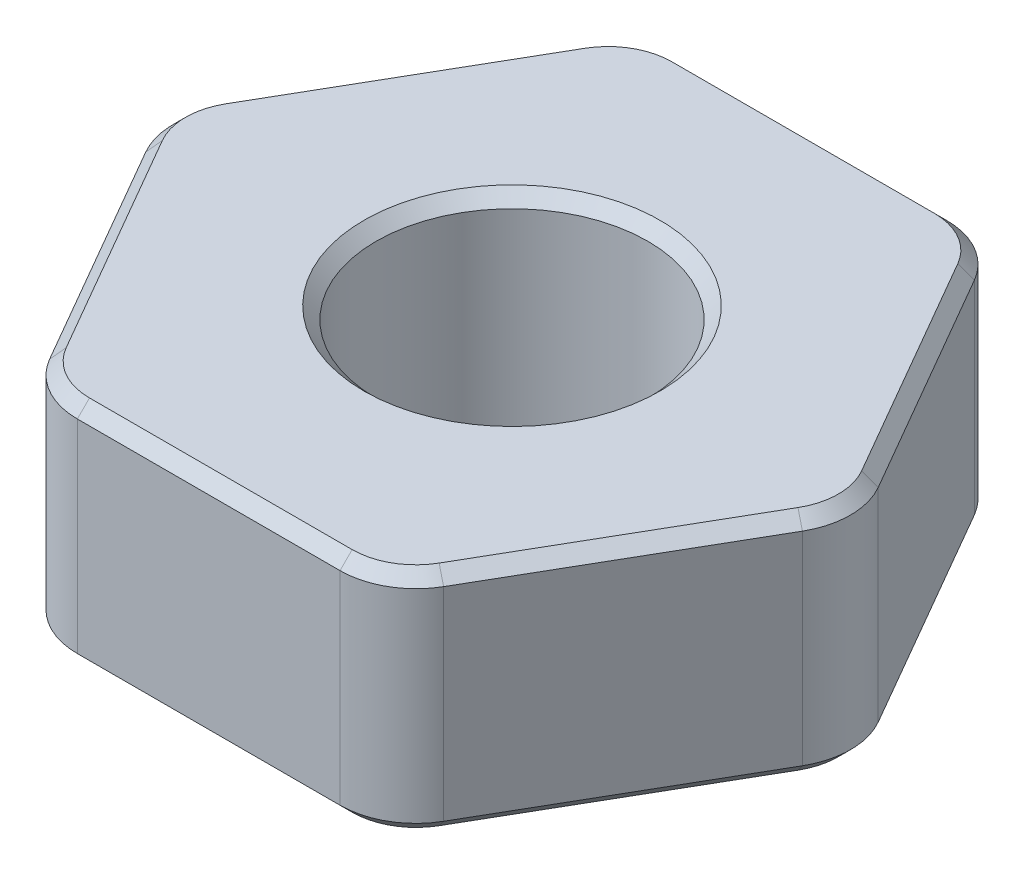
ISO-10303-21;
HEADER;
FILE_DESCRIPTION(('STEP AP214'),'2;1');
FILE_NAME('part.step','',(''),(''),'','','');
FILE_SCHEMA(('AUTOMOTIVE_DESIGN { 1 0 10303 214 1 1 1 1 }'));
ENDSEC;
DATA;
#1=APPLICATION_CONTEXT('core data for automotive mechanical design processes');
#2=APPLICATION_PROTOCOL_DEFINITION('international standard','automotive_design',2000,#1);
#3=PRODUCT_CONTEXT('',#1,'mechanical');
#4=PRODUCT('Part','Part','',(#3));
#5=PRODUCT_RELATED_PRODUCT_CATEGORY('part','',(#4));
#6=PRODUCT_DEFINITION_FORMATION('','',#4);
#7=PRODUCT_DEFINITION_CONTEXT('part definition',#1,'design');
#8=PRODUCT_DEFINITION('design','',#6,#7);
#9=PRODUCT_DEFINITION_SHAPE('','',#8);
#10=(LENGTH_UNIT() NAMED_UNIT(*) SI_UNIT(.MILLI.,.METRE.));
#11=(NAMED_UNIT(*) PLANE_ANGLE_UNIT() SI_UNIT($,.RADIAN.));
#12=(NAMED_UNIT(*) SI_UNIT($,.STERADIAN.) SOLID_ANGLE_UNIT());
#13=UNCERTAINTY_MEASURE_WITH_UNIT(LENGTH_MEASURE(1.E-05),#10,'distance_accuracy_value','');
#14=(GEOMETRIC_REPRESENTATION_CONTEXT(3) GLOBAL_UNCERTAINTY_ASSIGNED_CONTEXT((#13)) GLOBAL_UNIT_ASSIGNED_CONTEXT((#10,
#11,#12)) REPRESENTATION_CONTEXT('',''));
#15=CARTESIAN_POINT('',(0.,0.,0.));
#16=DIRECTION('',(0.,0.,1.));
#17=DIRECTION('',(1.,0.,0.));
#18=AXIS2_PLACEMENT_3D('',#15,#16,#17);
#19=CARTESIAN_POINT('',(0.,1.190625,0.));
#20=DIRECTION('',(0.,1.,0.));
#21=DIRECTION('',(0.,0.,1.));
#22=AXIS2_PLACEMENT_3D('',#19,#20,#21);
#23=PLANE('',#22);
#24=CARTESIAN_POINT('',(0.,1.190625,0.));
#25=DIRECTION('',(0.,1.,0.));
#26=DIRECTION('',(0.,0.,1.));
#27=AXIS2_PLACEMENT_3D('',#24,#25,#26);
#28=CIRCLE('',#27,1.5494);
#29=CARTESIAN_POINT('',(0.,1.190625,1.5494));
#30=VERTEX_POINT('',#29);
#31=EDGE_CURVE('E327',#30,#30,#28,.F.);
#32=ORIENTED_EDGE('',*,*,#31,.T.);
#33=EDGE_LOOP('',(#32));
#34=FACE_BOUND('',#33,.T.);
#35=CARTESIAN_POINT('',(1.3748153285078,1.190625,-2.38125));
#36=DIRECTION('',(0.,1.,0.));
#37=DIRECTION('',(0.,0.,1.));
#38=AXIS2_PLACEMENT_3D('',#35,#36,#37);
#39=CIRCLE('',#38,0.666750000000001);
#40=CARTESIAN_POINT('',(1.95223776648107,1.190625,-2.714625));
#41=VERTEX_POINT('',#40);
#42=CARTESIAN_POINT('',(1.3748153285078,1.190625,-3.048));
#43=VERTEX_POINT('',#42);
#44=EDGE_CURVE('E335',#41,#43,#39,.T.);
#45=ORIENTED_EDGE('',*,*,#44,.T.);
#46=DIRECTION('',(-1.,0.,0.));
#47=VECTOR('',#46,1.);
#48=CARTESIAN_POINT('',(-1.3748153285078,1.190625,-3.048));
#49=LINE('',#48,#47);
#50=CARTESIAN_POINT('',(-1.3748153285078,1.190625,-3.048));
#51=VERTEX_POINT('',#50);
#52=EDGE_CURVE('E330',#43,#51,#49,.T.);
#53=ORIENTED_EDGE('',*,*,#52,.T.);
#54=CARTESIAN_POINT('',(-1.3748153285078,1.190625,-2.38125));
#55=DIRECTION('',(0.,1.,0.));
#56=DIRECTION('',(0.,0.,1.));
#57=AXIS2_PLACEMENT_3D('',#54,#55,#56);
#58=CIRCLE('',#57,0.66675);
#59=CARTESIAN_POINT('',(-1.95223776648107,1.190625,-2.714625));
#60=VERTEX_POINT('',#59);
#61=EDGE_CURVE('E333',#51,#60,#58,.T.);
#62=ORIENTED_EDGE('',*,*,#61,.T.);
#63=DIRECTION('',(-0.5,0.,0.866025403784439));
#64=VECTOR('',#63,1.);
#65=CARTESIAN_POINT('',(-3.32705309498887,1.190625,-0.333375));
#66=LINE('',#65,#64);
#67=CARTESIAN_POINT('',(-3.32705309498887,1.190625,-0.333375));
#68=VERTEX_POINT('',#67);
#69=EDGE_CURVE('E337',#60,#68,#66,.T.);
#70=ORIENTED_EDGE('',*,*,#69,.T.);
#71=CARTESIAN_POINT('',(-2.74963065701559,1.190625,0.));
#72=DIRECTION('',(0.,1.,0.));
#73=DIRECTION('',(0.,0.,1.));
#74=AXIS2_PLACEMENT_3D('',#71,#72,#73);
#75=CIRCLE('',#74,0.666750000000001);
#76=CARTESIAN_POINT('',(-3.32705309498887,1.190625,0.333375000000001));
#77=VERTEX_POINT('',#76);
#78=EDGE_CURVE('E341',#68,#77,#75,.T.);
#79=ORIENTED_EDGE('',*,*,#78,.T.);
#80=DIRECTION('',(0.5,0.,0.866025403784439));
#81=VECTOR('',#80,1.);
#82=CARTESIAN_POINT('',(-1.95223776648107,1.190625,2.714625));
#83=LINE('',#82,#81);
#84=CARTESIAN_POINT('',(-1.95223776648107,1.190625,2.714625));
#85=VERTEX_POINT('',#84);
#86=EDGE_CURVE('E345',#77,#85,#83,.T.);
#87=ORIENTED_EDGE('',*,*,#86,.T.);
#88=CARTESIAN_POINT('',(-1.37481532850779,1.190625,2.38125));
#89=DIRECTION('',(0.,1.,0.));
#90=DIRECTION('',(0.,0.,1.));
#91=AXIS2_PLACEMENT_3D('',#88,#89,#90);
#92=CIRCLE('',#91,0.666750000000001);
#93=CARTESIAN_POINT('',(-1.37481532850779,1.190625,3.048));
#94=VERTEX_POINT('',#93);
#95=EDGE_CURVE('E349',#85,#94,#92,.T.);
#96=ORIENTED_EDGE('',*,*,#95,.T.);
#97=DIRECTION('',(1.,0.,0.));
#98=VECTOR('',#97,1.);
#99=CARTESIAN_POINT('',(1.3748153285078,1.190625,3.048));
#100=LINE('',#99,#98);
#101=CARTESIAN_POINT('',(1.3748153285078,1.190625,3.048));
#102=VERTEX_POINT('',#101);
#103=EDGE_CURVE('E353',#94,#102,#100,.T.);
#104=ORIENTED_EDGE('',*,*,#103,.T.);
#105=CARTESIAN_POINT('',(1.3748153285078,1.190625,2.38125));
#106=DIRECTION('',(0.,1.,0.));
#107=DIRECTION('',(0.,0.,1.));
#108=AXIS2_PLACEMENT_3D('',#105,#106,#107);
#109=CIRCLE('',#108,0.66675);
#110=CARTESIAN_POINT('',(1.95223776648107,1.190625,2.714625));
#111=VERTEX_POINT('',#110);
#112=EDGE_CURVE('E351',#102,#111,#109,.T.);
#113=ORIENTED_EDGE('',*,*,#112,.T.);
#114=DIRECTION('',(0.5,0.,-0.866025403784439));
#115=VECTOR('',#114,1.);
#116=CARTESIAN_POINT('',(3.32705309498887,1.190625,0.333375000000002));
#117=LINE('',#116,#115);
#118=CARTESIAN_POINT('',(3.32705309498887,1.190625,0.333375000000001));
#119=VERTEX_POINT('',#118);
#120=EDGE_CURVE('E347',#111,#119,#117,.T.);
#121=ORIENTED_EDGE('',*,*,#120,.T.);
#122=CARTESIAN_POINT('',(2.74963065701559,1.190625,0.));
#123=DIRECTION('',(0.,1.,0.));
#124=DIRECTION('',(0.,0.,1.));
#125=AXIS2_PLACEMENT_3D('',#122,#123,#124);
#126=CIRCLE('',#125,0.666750000000001);
#127=CARTESIAN_POINT('',(3.32705309498887,1.190625,-0.333375));
#128=VERTEX_POINT('',#127);
#129=EDGE_CURVE('E343',#119,#128,#126,.T.);
#130=ORIENTED_EDGE('',*,*,#129,.T.);
#131=DIRECTION('',(-0.5,0.,-0.866025403784439));
#132=VECTOR('',#131,1.);
#133=CARTESIAN_POINT('',(1.95223776648107,1.190625,-2.714625));
#134=LINE('',#133,#132);
#135=EDGE_CURVE('E339',#128,#41,#134,.T.);
#136=ORIENTED_EDGE('',*,*,#135,.T.);
#137=EDGE_LOOP('',(#45,#53,#62,#70,#79,#87,#96,#104,#113,#121,#130,#136));
#138=FACE_BOUND('',#137,.T.);
#139=ADVANCED_FACE('F32',(#34,#138),#23,.T.);
#140=CARTESIAN_POINT('',(0.,-1.190625,0.));
#141=DIRECTION('',(0.,1.,0.));
#142=DIRECTION('',(0.,0.,1.));
#143=AXIS2_PLACEMENT_3D('',#140,#141,#142);
#144=PLANE('',#143);
#145=CARTESIAN_POINT('',(0.,-1.190625,0.));
#146=DIRECTION('',(0.,1.,0.));
#147=DIRECTION('',(0.,0.,1.));
#148=AXIS2_PLACEMENT_3D('',#145,#146,#147);
#149=CIRCLE('',#148,1.5494);
#150=CARTESIAN_POINT('',(0.,-1.190625,1.5494));
#151=VERTEX_POINT('',#150);
#152=EDGE_CURVE('E361',#151,#151,#149,.T.);
#153=ORIENTED_EDGE('',*,*,#152,.T.);
#154=EDGE_LOOP('',(#153));
#155=FACE_BOUND('',#154,.T.);
#156=CARTESIAN_POINT('',(-1.3748153285078,-1.190625,-2.38125));
#157=DIRECTION('',(0.,1.,0.));
#158=DIRECTION('',(0.,0.,1.));
#159=AXIS2_PLACEMENT_3D('',#156,#157,#158);
#160=CIRCLE('',#159,0.666749999999999);
#161=CARTESIAN_POINT('',(-1.95223776648107,-1.190625,-2.714625));
#162=VERTEX_POINT('',#161);
#163=CARTESIAN_POINT('',(-1.3748153285078,-1.190625,-3.048));
#164=VERTEX_POINT('',#163);
#165=EDGE_CURVE('E367',#162,#164,#160,.F.);
#166=ORIENTED_EDGE('',*,*,#165,.T.);
#167=DIRECTION('',(1.,0.,0.));
#168=VECTOR('',#167,1.);
#169=CARTESIAN_POINT('',(0.,-1.190625,-3.048));
#170=LINE('',#169,#168);
#171=CARTESIAN_POINT('',(1.3748153285078,-1.190625,-3.048));
#172=VERTEX_POINT('',#171);
#173=EDGE_CURVE('E364',#164,#172,#170,.T.);
#174=ORIENTED_EDGE('',*,*,#173,.T.);
#175=CARTESIAN_POINT('',(1.3748153285078,-1.190625,-2.38125));
#176=DIRECTION('',(0.,1.,0.));
#177=DIRECTION('',(0.,0.,1.));
#178=AXIS2_PLACEMENT_3D('',#175,#176,#177);
#179=CIRCLE('',#178,0.666749999999999);
#180=CARTESIAN_POINT('',(1.95223776648107,-1.190625,-2.714625));
#181=VERTEX_POINT('',#180);
#182=EDGE_CURVE('E369',#172,#181,#179,.F.);
#183=ORIENTED_EDGE('',*,*,#182,.T.);
#184=DIRECTION('',(0.5,0.,0.866025403784439));
#185=VECTOR('',#184,1.);
#186=CARTESIAN_POINT('',(2.63964543073497,-1.190625,-1.524));
#187=LINE('',#186,#185);
#188=CARTESIAN_POINT('',(3.32705309498887,-1.190625,-0.333375));
#189=VERTEX_POINT('',#188);
#190=EDGE_CURVE('E373',#181,#189,#187,.T.);
#191=ORIENTED_EDGE('',*,*,#190,.T.);
#192=CARTESIAN_POINT('',(2.74963065701559,-1.190625,0.));
#193=DIRECTION('',(0.,1.,0.));
#194=DIRECTION('',(0.,0.,1.));
#195=AXIS2_PLACEMENT_3D('',#192,#193,#194);
#196=CIRCLE('',#195,0.666749999999999);
#197=CARTESIAN_POINT('',(3.32705309498887,-1.190625,0.333375));
#198=VERTEX_POINT('',#197);
#199=EDGE_CURVE('E377',#189,#198,#196,.F.);
#200=ORIENTED_EDGE('',*,*,#199,.T.);
#201=DIRECTION('',(-0.5,0.,0.866025403784439));
#202=VECTOR('',#201,1.);
#203=CARTESIAN_POINT('',(2.63964543073497,-1.190625,1.524));
#204=LINE('',#203,#202);
#205=CARTESIAN_POINT('',(1.95223776648107,-1.190625,2.714625));
#206=VERTEX_POINT('',#205);
#207=EDGE_CURVE('E200',#198,#206,#204,.T.);
#208=ORIENTED_EDGE('',*,*,#207,.T.);
#209=CARTESIAN_POINT('',(1.3748153285078,-1.190625,2.38125));
#210=DIRECTION('',(0.,1.,0.));
#211=DIRECTION('',(0.,0.,1.));
#212=AXIS2_PLACEMENT_3D('',#209,#210,#211);
#213=CIRCLE('',#212,0.666749999999999);
#214=CARTESIAN_POINT('',(1.3748153285078,-1.190625,3.048));
#215=VERTEX_POINT('',#214);
#216=EDGE_CURVE('E194',#206,#215,#213,.F.);
#217=ORIENTED_EDGE('',*,*,#216,.T.);
#218=DIRECTION('',(-1.,0.,0.));
#219=VECTOR('',#218,1.);
#220=CARTESIAN_POINT('',(0.,-1.190625,3.048));
#221=LINE('',#220,#219);
#222=CARTESIAN_POINT('',(-1.37481532850779,-1.190625,3.048));
#223=VERTEX_POINT('',#222);
#224=EDGE_CURVE('E197',#215,#223,#221,.T.);
#225=ORIENTED_EDGE('',*,*,#224,.T.);
#226=CARTESIAN_POINT('',(-1.37481532850779,-1.190625,2.38125));
#227=DIRECTION('',(0.,1.,0.));
#228=DIRECTION('',(0.,0.,1.));
#229=AXIS2_PLACEMENT_3D('',#226,#227,#228);
#230=CIRCLE('',#229,0.666749999999999);
#231=CARTESIAN_POINT('',(-1.95223776648107,-1.190625,2.714625));
#232=VERTEX_POINT('',#231);
#233=EDGE_CURVE('E205',#223,#232,#230,.F.);
#234=ORIENTED_EDGE('',*,*,#233,.T.);
#235=DIRECTION('',(-0.5,0.,-0.866025403784439));
#236=VECTOR('',#235,1.);
#237=CARTESIAN_POINT('',(-2.63964543073497,-1.190625,1.524));
#238=LINE('',#237,#236);
#239=CARTESIAN_POINT('',(-3.32705309498886,-1.190625,0.333375));
#240=VERTEX_POINT('',#239);
#241=EDGE_CURVE('E379',#232,#240,#238,.T.);
#242=ORIENTED_EDGE('',*,*,#241,.T.);
#243=CARTESIAN_POINT('',(-2.74963065701559,-1.190625,0.));
#244=DIRECTION('',(0.,1.,0.));
#245=DIRECTION('',(0.,0.,1.));
#246=AXIS2_PLACEMENT_3D('',#243,#244,#245);
#247=CIRCLE('',#246,0.666749999999999);
#248=CARTESIAN_POINT('',(-3.32705309498886,-1.190625,-0.333374999999999));
#249=VERTEX_POINT('',#248);
#250=EDGE_CURVE('E375',#240,#249,#247,.F.);
#251=ORIENTED_EDGE('',*,*,#250,.T.);
#252=DIRECTION('',(0.5,0.,-0.866025403784439));
#253=VECTOR('',#252,1.);
#254=CARTESIAN_POINT('',(-2.63964543073497,-1.190625,-1.524));
#255=LINE('',#254,#253);
#256=EDGE_CURVE('E371',#249,#162,#255,.T.);
#257=ORIENTED_EDGE('',*,*,#256,.T.);
#258=EDGE_LOOP('',(#166,#174,#183,#191,#200,#208,#217,#225,#234,#242,#251,#257));
#259=FACE_BOUND('',#258,.T.);
#260=ADVANCED_FACE('F196',(#155,#259),#144,.F.);
#261=CARTESIAN_POINT('',(3.66617420935412,1.190625,0.));
#262=DIRECTION('',(-0.866025403784439,0.,0.5));
#263=DIRECTION('',(0.5,0.,0.866025403784438));
#264=AXIS2_PLACEMENT_3D('',#261,#262,#263);
#265=PLANE('',#264);
#266=DIRECTION('',(0.,-1.,0.));
#267=VECTOR('',#266,1.);
#268=CARTESIAN_POINT('',(2.06222299276169,1.190625,-2.778125));
#269=LINE('',#268,#267);
#270=CARTESIAN_POINT('',(2.06222299276169,-1.063625,-2.778125));
#271=VERTEX_POINT('',#270);
#272=CARTESIAN_POINT('',(2.06222299276169,1.063625,-2.778125));
#273=VERTEX_POINT('',#272);
#274=EDGE_CURVE('E253',#271,#273,#269,.F.);
#275=ORIENTED_EDGE('',*,*,#274,.T.);
#276=DIRECTION('',(0.5,0.,0.866025403784438));
#277=VECTOR('',#276,1.);
#278=CARTESIAN_POINT('',(3.43703832126949,1.063625,-0.396875000000001));
#279=LINE('',#278,#277);
#280=CARTESIAN_POINT('',(3.43703832126949,1.063625,-0.396875));
#281=VERTEX_POINT('',#280);
#282=EDGE_CURVE('E305',#273,#281,#279,.T.);
#283=ORIENTED_EDGE('',*,*,#282,.T.);
#284=DIRECTION('',(0.,-1.,0.));
#285=VECTOR('',#284,1.);
#286=CARTESIAN_POINT('',(3.43703832126949,1.190625,-0.396875));
#287=LINE('',#286,#285);
#288=CARTESIAN_POINT('',(3.43703832126949,-1.063625,-0.396875));
#289=VERTEX_POINT('',#288);
#290=EDGE_CURVE('E410',#281,#289,#287,.T.);
#291=ORIENTED_EDGE('',*,*,#290,.T.);
#292=DIRECTION('',(-0.5,0.,-0.866025403784438));
#293=VECTOR('',#292,1.);
#294=CARTESIAN_POINT('',(3.66617420935412,-1.063625,0.));
#295=LINE('',#294,#293);
#296=EDGE_CURVE('E307',#289,#271,#295,.T.);
#297=ORIENTED_EDGE('',*,*,#296,.T.);
#298=EDGE_LOOP('',(#275,#283,#291,#297));
#299=FACE_BOUND('',#298,.T.);
#300=ADVANCED_FACE('F417',(#299),#265,.F.);
#301=CARTESIAN_POINT('',(1.83308710467706,1.190625,-3.175));
#302=DIRECTION('',(0.,0.,1.));
#303=DIRECTION('',(1.,0.,0.));
#304=AXIS2_PLACEMENT_3D('',#301,#302,#303);
#305=PLANE('',#304);
#306=DIRECTION('',(0.,-1.,0.));
#307=VECTOR('',#306,1.);
#308=CARTESIAN_POINT('',(-1.3748153285078,1.190625,-3.175));
#309=LINE('',#308,#307);
#310=CARTESIAN_POINT('',(-1.3748153285078,-1.063625,-3.175));
#311=VERTEX_POINT('',#310);
#312=CARTESIAN_POINT('',(-1.3748153285078,1.063625,-3.175));
#313=VERTEX_POINT('',#312);
#314=EDGE_CURVE('E213',#311,#313,#309,.F.);
#315=ORIENTED_EDGE('',*,*,#314,.T.);
#316=DIRECTION('',(1.,0.,0.));
#317=VECTOR('',#316,1.);
#318=CARTESIAN_POINT('',(1.3748153285078,1.063625,-3.175));
#319=LINE('',#318,#317);
#320=CARTESIAN_POINT('',(1.3748153285078,1.063625,-3.175));
#321=VERTEX_POINT('',#320);
#322=EDGE_CURVE('E321',#313,#321,#319,.T.);
#323=ORIENTED_EDGE('',*,*,#322,.T.);
#324=DIRECTION('',(0.,-1.,0.));
#325=VECTOR('',#324,1.);
#326=CARTESIAN_POINT('',(1.3748153285078,1.190625,-3.175));
#327=LINE('',#326,#325);
#328=CARTESIAN_POINT('',(1.3748153285078,-1.063625,-3.175));
#329=VERTEX_POINT('',#328);
#330=EDGE_CURVE('E385',#321,#329,#327,.T.);
#331=ORIENTED_EDGE('',*,*,#330,.T.);
#332=DIRECTION('',(-1.,0.,0.));
#333=VECTOR('',#332,1.);
#334=CARTESIAN_POINT('',(1.83308710467706,-1.063625,-3.175));
#335=LINE('',#334,#333);
#336=EDGE_CURVE('E324',#329,#311,#335,.T.);
#337=ORIENTED_EDGE('',*,*,#336,.T.);
#338=EDGE_LOOP('',(#315,#323,#331,#337));
#339=FACE_BOUND('',#338,.T.);
#340=ADVANCED_FACE('F537',(#339),#305,.F.);
#341=CARTESIAN_POINT('',(-1.83308710467706,1.190625,-3.175));
#342=DIRECTION('',(0.866025403784439,0.,0.5));
#343=DIRECTION('',(0.5,0.,-0.866025403784439));
#344=AXIS2_PLACEMENT_3D('',#341,#342,#343);
#345=PLANE('',#344);
#346=DIRECTION('',(0.,-1.,0.));
#347=VECTOR('',#346,1.);
#348=CARTESIAN_POINT('',(-3.43703832126949,1.190625,-0.396874999999999));
#349=LINE('',#348,#347);
#350=CARTESIAN_POINT('',(-3.43703832126949,-1.063625,-0.396874999999999));
#351=VERTEX_POINT('',#350);
#352=CARTESIAN_POINT('',(-3.43703832126949,1.063625,-0.396874999999999));
#353=VERTEX_POINT('',#352);
#354=EDGE_CURVE('E388',#351,#353,#349,.F.);
#355=ORIENTED_EDGE('',*,*,#354,.T.);
#356=DIRECTION('',(0.5,0.,-0.866025403784439));
#357=VECTOR('',#356,1.);
#358=CARTESIAN_POINT('',(-2.06222299276169,1.063625,-2.778125));
#359=LINE('',#358,#357);
#360=CARTESIAN_POINT('',(-2.06222299276169,1.063625,-2.778125));
#361=VERTEX_POINT('',#360);
#362=EDGE_CURVE('E309',#353,#361,#359,.T.);
#363=ORIENTED_EDGE('',*,*,#362,.T.);
#364=DIRECTION('',(0.,-1.,0.));
#365=VECTOR('',#364,1.);
#366=CARTESIAN_POINT('',(-2.06222299276169,1.190625,-2.778125));
#367=LINE('',#366,#365);
#368=CARTESIAN_POINT('',(-2.06222299276169,-1.063625,-2.778125));
#369=VERTEX_POINT('',#368);
#370=EDGE_CURVE('E391',#361,#369,#367,.T.);
#371=ORIENTED_EDGE('',*,*,#370,.T.);
#372=DIRECTION('',(-0.5,0.,0.866025403784439));
#373=VECTOR('',#372,1.);
#374=CARTESIAN_POINT('',(-1.83308710467706,-1.063625,-3.175));
#375=LINE('',#374,#373);
#376=EDGE_CURVE('E311',#369,#351,#375,.T.);
#377=ORIENTED_EDGE('',*,*,#376,.T.);
#378=EDGE_LOOP('',(#355,#363,#371,#377));
#379=FACE_BOUND('',#378,.T.);
#380=ADVANCED_FACE('F533',(#379),#345,.F.);
#381=CARTESIAN_POINT('',(-3.66617420935412,1.190625,0.));
#382=DIRECTION('',(0.866025403784439,0.,-0.5));
#383=DIRECTION('',(-0.5,0.,-0.866025403784438));
#384=AXIS2_PLACEMENT_3D('',#381,#382,#383);
#385=PLANE('',#384);
#386=DIRECTION('',(0.,-1.,0.));
#387=VECTOR('',#386,1.);
#388=CARTESIAN_POINT('',(-2.06222299276169,1.190625,2.778125));
#389=LINE('',#388,#387);
#390=CARTESIAN_POINT('',(-2.06222299276169,-1.063625,2.778125));
#391=VERTEX_POINT('',#390);
#392=CARTESIAN_POINT('',(-2.06222299276169,1.063625,2.778125));
#393=VERTEX_POINT('',#392);
#394=EDGE_CURVE('E397',#391,#393,#389,.F.);
#395=ORIENTED_EDGE('',*,*,#394,.T.);
#396=DIRECTION('',(-0.5,0.,-0.866025403784438));
#397=VECTOR('',#396,1.);
#398=CARTESIAN_POINT('',(-3.43703832126949,1.063625,0.396875000000001));
#399=LINE('',#398,#397);
#400=CARTESIAN_POINT('',(-3.43703832126949,1.063625,0.396875000000001));
#401=VERTEX_POINT('',#400);
#402=EDGE_CURVE('E293',#393,#401,#399,.T.);
#403=ORIENTED_EDGE('',*,*,#402,.T.);
#404=DIRECTION('',(0.,-1.,0.));
#405=VECTOR('',#404,1.);
#406=CARTESIAN_POINT('',(-3.43703832126949,1.190625,0.396875000000001));
#407=LINE('',#406,#405);
#408=CARTESIAN_POINT('',(-3.43703832126949,-1.063625,0.396875000000001));
#409=VERTEX_POINT('',#408);
#410=EDGE_CURVE('E394',#401,#409,#407,.T.);
#411=ORIENTED_EDGE('',*,*,#410,.T.);
#412=DIRECTION('',(0.5,0.,0.866025403784438));
#413=VECTOR('',#412,1.);
#414=CARTESIAN_POINT('',(-3.66617420935412,-1.063625,0.));
#415=LINE('',#414,#413);
#416=EDGE_CURVE('E295',#409,#391,#415,.T.);
#417=ORIENTED_EDGE('',*,*,#416,.T.);
#418=EDGE_LOOP('',(#395,#403,#411,#417));
#419=FACE_BOUND('',#418,.T.);
#420=ADVANCED_FACE('F530',(#419),#385,.F.);
#421=CARTESIAN_POINT('',(-1.83308710467706,1.190625,3.175));
#422=DIRECTION('',(0.,0.,-1.));
#423=DIRECTION('',(-1.,0.,0.));
#424=AXIS2_PLACEMENT_3D('',#421,#422,#423);
#425=PLANE('',#424);
#426=DIRECTION('',(0.,-1.,0.));
#427=VECTOR('',#426,1.);
#428=CARTESIAN_POINT('',(1.3748153285078,1.190625,3.175));
#429=LINE('',#428,#427);
#430=CARTESIAN_POINT('',(1.3748153285078,-1.063625,3.175));
#431=VERTEX_POINT('',#430);
#432=CARTESIAN_POINT('',(1.3748153285078,1.063625,3.175));
#433=VERTEX_POINT('',#432);
#434=EDGE_CURVE('E400',#431,#433,#429,.F.);
#435=ORIENTED_EDGE('',*,*,#434,.T.);
#436=DIRECTION('',(-1.,0.,0.));
#437=VECTOR('',#436,1.);
#438=CARTESIAN_POINT('',(-1.37481532850779,1.063625,3.175));
#439=LINE('',#438,#437);
#440=CARTESIAN_POINT('',(-1.37481532850779,1.063625,3.175));
#441=VERTEX_POINT('',#440);
#442=EDGE_CURVE('E11',#433,#441,#439,.T.);
#443=ORIENTED_EDGE('',*,*,#442,.T.);
#444=DIRECTION('',(0.,-1.,0.));
#445=VECTOR('',#444,1.);
#446=CARTESIAN_POINT('',(-1.37481532850779,1.190625,3.175));
#447=LINE('',#446,#445);
#448=CARTESIAN_POINT('',(-1.37481532850779,-1.063625,3.175));
#449=VERTEX_POINT('',#448);
#450=EDGE_CURVE('E402',#441,#449,#447,.T.);
#451=ORIENTED_EDGE('',*,*,#450,.T.);
#452=DIRECTION('',(1.,0.,0.));
#453=VECTOR('',#452,1.);
#454=CARTESIAN_POINT('',(-1.83308710467706,-1.063625,3.175));
#455=LINE('',#454,#453);
#456=EDGE_CURVE('E41',#449,#431,#455,.T.);
#457=ORIENTED_EDGE('',*,*,#456,.T.);
#458=EDGE_LOOP('',(#435,#443,#451,#457));
#459=FACE_BOUND('',#458,.T.);
#460=ADVANCED_FACE('F462',(#459),#425,.F.);
#461=CARTESIAN_POINT('',(1.83308710467706,1.190625,3.175));
#462=DIRECTION('',(-0.866025403784439,0.,-0.5));
#463=DIRECTION('',(-0.5,0.,0.866025403784439));
#464=AXIS2_PLACEMENT_3D('',#461,#462,#463);
#465=PLANE('',#464);
#466=DIRECTION('',(0.,-1.,0.));
#467=VECTOR('',#466,1.);
#468=CARTESIAN_POINT('',(3.43703832126949,1.190625,0.396875));
#469=LINE('',#468,#467);
#470=CARTESIAN_POINT('',(3.43703832126949,-1.063625,0.396875));
#471=VERTEX_POINT('',#470);
#472=CARTESIAN_POINT('',(3.43703832126949,1.063625,0.396875));
#473=VERTEX_POINT('',#472);
#474=EDGE_CURVE('E404',#471,#473,#469,.F.);
#475=ORIENTED_EDGE('',*,*,#474,.T.);
#476=DIRECTION('',(-0.5,0.,0.866025403784439));
#477=VECTOR('',#476,1.);
#478=CARTESIAN_POINT('',(2.06222299276169,1.063625,2.778125));
#479=LINE('',#478,#477);
#480=CARTESIAN_POINT('',(2.06222299276169,1.063625,2.778125));
#481=VERTEX_POINT('',#480);
#482=EDGE_CURVE('E289',#473,#481,#479,.T.);
#483=ORIENTED_EDGE('',*,*,#482,.T.);
#484=DIRECTION('',(0.,-1.,0.));
#485=VECTOR('',#484,1.);
#486=CARTESIAN_POINT('',(2.06222299276169,1.190625,2.778125));
#487=LINE('',#486,#485);
#488=CARTESIAN_POINT('',(2.06222299276169,-1.063625,2.778125));
#489=VERTEX_POINT('',#488);
#490=EDGE_CURVE('E407',#481,#489,#487,.T.);
#491=ORIENTED_EDGE('',*,*,#490,.T.);
#492=DIRECTION('',(0.5,0.,-0.866025403784439));
#493=VECTOR('',#492,1.);
#494=CARTESIAN_POINT('',(1.83308710467706,-1.063625,3.175));
#495=LINE('',#494,#493);
#496=EDGE_CURVE('E291',#489,#471,#495,.T.);
#497=ORIENTED_EDGE('',*,*,#496,.T.);
#498=EDGE_LOOP('',(#475,#483,#491,#497));
#499=FACE_BOUND('',#498,.T.);
#500=ADVANCED_FACE('F446',(#499),#465,.F.);
#501=CARTESIAN_POINT('',(0.,1.190625,0.));
#502=DIRECTION('',(0.,-1.,0.));
#503=DIRECTION('',(0.,0.,-1.));
#504=AXIS2_PLACEMENT_3D('',#501,#502,#503);
#505=CYLINDRICAL_SURFACE('',#504,1.4224);
#506=CARTESIAN_POINT('',(0.,-1.063625,0.));
#507=DIRECTION('',(0.,1.,0.));
#508=DIRECTION('',(0.,0.,1.));
#509=AXIS2_PLACEMENT_3D('',#506,#507,#508);
#510=CIRCLE('',#509,1.4224);
#511=CARTESIAN_POINT('',(0.,-1.063625,1.4224));
#512=VERTEX_POINT('',#511);
#513=EDGE_CURVE('E355',#512,#512,#510,.F.);
#514=ORIENTED_EDGE('',*,*,#513,.T.);
#515=EDGE_LOOP('',(#514));
#516=FACE_BOUND('',#515,.T.);
#517=CARTESIAN_POINT('',(0.,1.063625,0.));
#518=DIRECTION('',(0.,1.,0.));
#519=DIRECTION('',(0.,0.,1.));
#520=AXIS2_PLACEMENT_3D('',#517,#518,#519);
#521=CIRCLE('',#520,1.4224);
#522=CARTESIAN_POINT('',(0.,1.063625,1.4224));
#523=VERTEX_POINT('',#522);
#524=EDGE_CURVE('E358',#523,#523,#521,.T.);
#525=ORIENTED_EDGE('',*,*,#524,.T.);
#526=EDGE_LOOP('',(#525));
#527=FACE_BOUND('',#526,.T.);
#528=ADVANCED_FACE('F524',(#516,#527),#505,.F.);
#529=CARTESIAN_POINT('',(2.74963065701559,1.190625,0.));
#530=DIRECTION('',(0.,-1.,0.));
#531=DIRECTION('',(0.,0.,-1.));
#532=AXIS2_PLACEMENT_3D('',#529,#530,#531);
#533=CYLINDRICAL_SURFACE('',#532,0.79375);
#534=ORIENTED_EDGE('',*,*,#290,.F.);
#535=CARTESIAN_POINT('',(2.74963065701559,1.063625,0.));
#536=DIRECTION('',(0.,1.,0.));
#537=DIRECTION('',(0.,0.,1.));
#538=AXIS2_PLACEMENT_3D('',#535,#536,#537);
#539=CIRCLE('',#538,0.79375);
#540=EDGE_CURVE('E297',#281,#473,#539,.F.);
#541=ORIENTED_EDGE('',*,*,#540,.T.);
#542=ORIENTED_EDGE('',*,*,#474,.F.);
#543=CARTESIAN_POINT('',(2.74963065701559,-1.063625,0.));
#544=DIRECTION('',(0.,1.,0.));
#545=DIRECTION('',(0.,0.,1.));
#546=AXIS2_PLACEMENT_3D('',#543,#544,#545);
#547=CIRCLE('',#546,0.79375);
#548=EDGE_CURVE('E299',#471,#289,#547,.T.);
#549=ORIENTED_EDGE('',*,*,#548,.T.);
#550=EDGE_LOOP('',(#534,#541,#542,#549));
#551=FACE_BOUND('',#550,.T.);
#552=ADVANCED_FACE('F442',(#551),#533,.T.);
#553=CARTESIAN_POINT('',(1.3748153285078,1.190625,2.38125));
#554=DIRECTION('',(0.,-1.,0.));
#555=DIRECTION('',(0.,0.,-1.));
#556=AXIS2_PLACEMENT_3D('',#553,#554,#555);
#557=CYLINDRICAL_SURFACE('',#556,0.79375);
#558=ORIENTED_EDGE('',*,*,#490,.F.);
#559=CARTESIAN_POINT('',(1.3748153285078,1.063625,2.38125));
#560=DIRECTION('',(0.,1.,0.));
#561=DIRECTION('',(0.,0.,1.));
#562=AXIS2_PLACEMENT_3D('',#559,#560,#561);
#563=CIRCLE('',#562,0.79375);
#564=EDGE_CURVE('E49',#481,#433,#563,.F.);
#565=ORIENTED_EDGE('',*,*,#564,.T.);
#566=ORIENTED_EDGE('',*,*,#434,.F.);
#567=CARTESIAN_POINT('',(1.3748153285078,-1.063625,2.38125));
#568=DIRECTION('',(0.,1.,0.));
#569=DIRECTION('',(0.,0.,1.));
#570=AXIS2_PLACEMENT_3D('',#567,#568,#569);
#571=CIRCLE('',#570,0.79375);
#572=EDGE_CURVE('E216',#431,#489,#571,.T.);
#573=ORIENTED_EDGE('',*,*,#572,.T.);
#574=EDGE_LOOP('',(#558,#565,#566,#573));
#575=FACE_BOUND('',#574,.T.);
#576=ADVANCED_FACE('F546',(#575),#557,.T.);
#577=CARTESIAN_POINT('',(-2.74963065701559,1.190625,0.));
#578=DIRECTION('',(0.,-1.,0.));
#579=DIRECTION('',(0.,0.,-1.));
#580=AXIS2_PLACEMENT_3D('',#577,#578,#579);
#581=CYLINDRICAL_SURFACE('',#580,0.79375);
#582=ORIENTED_EDGE('',*,*,#410,.F.);
#583=CARTESIAN_POINT('',(-2.74963065701559,1.063625,0.));
#584=DIRECTION('',(0.,1.,0.));
#585=DIRECTION('',(0.,0.,1.));
#586=AXIS2_PLACEMENT_3D('',#583,#584,#585);
#587=CIRCLE('',#586,0.79375);
#588=EDGE_CURVE('E301',#401,#353,#587,.F.);
#589=ORIENTED_EDGE('',*,*,#588,.T.);
#590=ORIENTED_EDGE('',*,*,#354,.F.);
#591=CARTESIAN_POINT('',(-2.74963065701559,-1.063625,0.));
#592=DIRECTION('',(0.,1.,0.));
#593=DIRECTION('',(0.,0.,1.));
#594=AXIS2_PLACEMENT_3D('',#591,#592,#593);
#595=CIRCLE('',#594,0.79375);
#596=EDGE_CURVE('E303',#351,#409,#595,.T.);
#597=ORIENTED_EDGE('',*,*,#596,.T.);
#598=EDGE_LOOP('',(#582,#589,#590,#597));
#599=FACE_BOUND('',#598,.T.);
#600=ADVANCED_FACE('F549',(#599),#581,.T.);
#601=CARTESIAN_POINT('',(-1.3748153285078,1.190625,-2.38125));
#602=DIRECTION('',(0.,-1.,0.));
#603=DIRECTION('',(0.,0.,-1.));
#604=AXIS2_PLACEMENT_3D('',#601,#602,#603);
#605=CYLINDRICAL_SURFACE('',#604,0.79375);
#606=ORIENTED_EDGE('',*,*,#370,.F.);
#607=CARTESIAN_POINT('',(-1.3748153285078,1.063625,-2.38125));
#608=DIRECTION('',(0.,1.,0.));
#609=DIRECTION('',(0.,0.,1.));
#610=AXIS2_PLACEMENT_3D('',#607,#608,#609);
#611=CIRCLE('',#610,0.79375);
#612=EDGE_CURVE('E317',#361,#313,#611,.F.);
#613=ORIENTED_EDGE('',*,*,#612,.T.);
#614=ORIENTED_EDGE('',*,*,#314,.F.);
#615=CARTESIAN_POINT('',(-1.3748153285078,-1.063625,-2.38125));
#616=DIRECTION('',(0.,1.,0.));
#617=DIRECTION('',(0.,0.,1.));
#618=AXIS2_PLACEMENT_3D('',#615,#616,#617);
#619=CIRCLE('',#618,0.79375);
#620=EDGE_CURVE('E319',#311,#369,#619,.T.);
#621=ORIENTED_EDGE('',*,*,#620,.T.);
#622=EDGE_LOOP('',(#606,#613,#614,#621));
#623=FACE_BOUND('',#622,.T.);
#624=ADVANCED_FACE('F552',(#623),#605,.T.);
#625=CARTESIAN_POINT('',(1.3748153285078,1.190625,-2.38125));
#626=DIRECTION('',(0.,-1.,0.));
#627=DIRECTION('',(0.,0.,-1.));
#628=AXIS2_PLACEMENT_3D('',#625,#626,#627);
#629=CYLINDRICAL_SURFACE('',#628,0.79375);
#630=ORIENTED_EDGE('',*,*,#330,.F.);
#631=CARTESIAN_POINT('',(1.3748153285078,1.063625,-2.38125));
#632=DIRECTION('',(0.,1.,0.));
#633=DIRECTION('',(0.,0.,1.));
#634=AXIS2_PLACEMENT_3D('',#631,#632,#633);
#635=CIRCLE('',#634,0.79375);
#636=EDGE_CURVE('E313',#321,#273,#635,.F.);
#637=ORIENTED_EDGE('',*,*,#636,.T.);
#638=ORIENTED_EDGE('',*,*,#274,.F.);
#639=CARTESIAN_POINT('',(1.3748153285078,-1.063625,-2.38125));
#640=DIRECTION('',(0.,1.,0.));
#641=DIRECTION('',(0.,0.,1.));
#642=AXIS2_PLACEMENT_3D('',#639,#640,#641);
#643=CIRCLE('',#642,0.79375);
#644=EDGE_CURVE('E315',#271,#329,#643,.T.);
#645=ORIENTED_EDGE('',*,*,#644,.T.);
#646=EDGE_LOOP('',(#630,#637,#638,#645));
#647=FACE_BOUND('',#646,.T.);
#648=ADVANCED_FACE('F556',(#647),#629,.T.);
#649=CARTESIAN_POINT('',(-1.37481532850779,1.190625,2.38125));
#650=DIRECTION('',(0.,-1.,0.));
#651=DIRECTION('',(0.,0.,-1.));
#652=AXIS2_PLACEMENT_3D('',#649,#650,#651);
#653=CYLINDRICAL_SURFACE('',#652,0.79375);
#654=ORIENTED_EDGE('',*,*,#450,.F.);
#655=CARTESIAN_POINT('',(-1.37481532850779,1.063625,2.38125));
#656=DIRECTION('',(0.,1.,0.));
#657=DIRECTION('',(0.,0.,1.));
#658=AXIS2_PLACEMENT_3D('',#655,#656,#657);
#659=CIRCLE('',#658,0.79375);
#660=EDGE_CURVE('E285',#441,#393,#659,.F.);
#661=ORIENTED_EDGE('',*,*,#660,.T.);
#662=ORIENTED_EDGE('',*,*,#394,.F.);
#663=CARTESIAN_POINT('',(-1.37481532850779,-1.063625,2.38125));
#664=DIRECTION('',(0.,1.,0.));
#665=DIRECTION('',(0.,0.,1.));
#666=AXIS2_PLACEMENT_3D('',#663,#664,#665);
#667=CIRCLE('',#666,0.79375);
#668=EDGE_CURVE('E287',#391,#449,#667,.T.);
#669=ORIENTED_EDGE('',*,*,#668,.T.);
#670=EDGE_LOOP('',(#654,#661,#662,#669));
#671=FACE_BOUND('',#670,.T.);
#672=ADVANCED_FACE('F464',(#671),#653,.T.);
#673=CARTESIAN_POINT('',(0.,-1.190625,0.));
#674=DIRECTION('',(0.,-1.,0.));
#675=DIRECTION('',(0.,0.,-1.));
#676=AXIS2_PLACEMENT_3D('',#673,#674,#675);
#677=CONICAL_SURFACE('',#676,1.5494,0.785398163397445);
#678=ORIENTED_EDGE('',*,*,#513,.F.);
#679=EDGE_LOOP('',(#678));
#680=FACE_BOUND('',#679,.T.);
#681=ORIENTED_EDGE('',*,*,#152,.F.);
#682=EDGE_LOOP('',(#681));
#683=FACE_BOUND('',#682,.T.);
#684=ADVANCED_FACE('F562',(#680,#683),#677,.F.);
#685=CARTESIAN_POINT('',(0.,1.063625,0.));
#686=DIRECTION('',(0.,1.,0.));
#687=DIRECTION('',(0.,0.,1.));
#688=AXIS2_PLACEMENT_3D('',#685,#686,#687);
#689=CONICAL_SURFACE('',#688,1.4224,0.785398163397442);
#690=ORIENTED_EDGE('',*,*,#31,.F.);
#691=EDGE_LOOP('',(#690));
#692=FACE_BOUND('',#691,.T.);
#693=ORIENTED_EDGE('',*,*,#524,.F.);
#694=EDGE_LOOP('',(#693));
#695=FACE_BOUND('',#694,.T.);
#696=ADVANCED_FACE('F565',(#692,#695),#689,.F.);
#697=CARTESIAN_POINT('',(0.,1.190625,3.048));
#698=DIRECTION('',(0.,0.707106781186545,0.70710678118655));
#699=DIRECTION('',(-1.,0.,0.));
#700=AXIS2_PLACEMENT_3D('',#697,#698,#699);
#701=PLANE('',#700);
#702=DIRECTION('',(0.,0.70710678118655,-0.707106781186545));
#703=VECTOR('',#702,1.);
#704=CARTESIAN_POINT('',(-1.37481532850779,1.063625,3.175));
#705=LINE('',#704,#703);
#706=EDGE_CURVE('E254',#441,#94,#705,.T.);
#707=ORIENTED_EDGE('',*,*,#706,.F.);
#708=ORIENTED_EDGE('',*,*,#442,.F.);
#709=DIRECTION('',(0.,-0.70710678118655,0.707106781186545));
#710=VECTOR('',#709,1.);
#711=CARTESIAN_POINT('',(1.3748153285078,1.190625,3.048));
#712=LINE('',#711,#710);
#713=EDGE_CURVE('E250',#102,#433,#712,.T.);
#714=ORIENTED_EDGE('',*,*,#713,.F.);
#715=ORIENTED_EDGE('',*,*,#103,.F.);
#716=EDGE_LOOP('',(#707,#708,#714,#715));
#717=FACE_BOUND('',#716,.T.);
#718=ADVANCED_FACE('F459',(#717),#701,.T.);
#719=CARTESIAN_POINT('',(1.3748153285078,1.190625,2.38125));
#720=DIRECTION('',(0.,-1.,0.));
#721=DIRECTION('',(0.,0.,-1.));
#722=AXIS2_PLACEMENT_3D('',#719,#720,#721);
#723=CONICAL_SURFACE('',#722,0.66675,0.785398163397446);
#724=ORIENTED_EDGE('',*,*,#713,.T.);
#725=ORIENTED_EDGE('',*,*,#564,.F.);
#726=DIRECTION('',(0.612372435695794,-0.707106781186549,0.353553390593272));
#727=VECTOR('',#726,1.);
#728=CARTESIAN_POINT('',(1.95223776648107,1.190625,2.714625));
#729=LINE('',#728,#727);
#730=EDGE_CURVE('E257',#111,#481,#729,.T.);
#731=ORIENTED_EDGE('',*,*,#730,.F.);
#732=ORIENTED_EDGE('',*,*,#112,.F.);
#733=EDGE_LOOP('',(#724,#725,#731,#732));
#734=FACE_BOUND('',#733,.T.);
#735=ADVANCED_FACE('F453',(#734),#723,.T.);
#736=CARTESIAN_POINT('',(-1.37481532850779,1.190625,2.38125));
#737=DIRECTION('',(0.,-1.,0.));
#738=DIRECTION('',(0.,0.,-1.));
#739=AXIS2_PLACEMENT_3D('',#736,#737,#738);
#740=CONICAL_SURFACE('',#739,0.666750000000001,0.785398163397445);
#741=ORIENTED_EDGE('',*,*,#706,.T.);
#742=ORIENTED_EDGE('',*,*,#95,.F.);
#743=DIRECTION('',(0.612372435695792,0.707106781186552,-0.353553390593271));
#744=VECTOR('',#743,1.);
#745=CARTESIAN_POINT('',(-2.06222299276169,1.063625,2.778125));
#746=LINE('',#745,#744);
#747=EDGE_CURVE('E260',#393,#85,#746,.T.);
#748=ORIENTED_EDGE('',*,*,#747,.F.);
#749=ORIENTED_EDGE('',*,*,#660,.F.);
#750=EDGE_LOOP('',(#741,#742,#748,#749));
#751=FACE_BOUND('',#750,.T.);
#752=ADVANCED_FACE('F598',(#751),#740,.T.);
#753=CARTESIAN_POINT('',(2.63964543073497,1.190625,1.524));
#754=DIRECTION('',(0.612372435695798,0.707106781186543,0.353553390593276));
#755=DIRECTION('',(-0.5,0.,0.866025403784439));
#756=AXIS2_PLACEMENT_3D('',#753,#754,#755);
#757=PLANE('',#756);
#758=ORIENTED_EDGE('',*,*,#730,.T.);
#759=ORIENTED_EDGE('',*,*,#482,.F.);
#760=DIRECTION('',(0.612372435695791,-0.707106781186552,0.353553390593272));
#761=VECTOR('',#760,1.);
#762=CARTESIAN_POINT('',(3.32705309498887,1.190625,0.333375000000001));
#763=LINE('',#762,#761);
#764=EDGE_CURVE('E263',#119,#473,#763,.T.);
#765=ORIENTED_EDGE('',*,*,#764,.F.);
#766=ORIENTED_EDGE('',*,*,#120,.F.);
#767=EDGE_LOOP('',(#758,#759,#765,#766));
#768=FACE_BOUND('',#767,.T.);
#769=ADVANCED_FACE('F449',(#768),#757,.T.);
#770=CARTESIAN_POINT('',(-2.63964543073497,1.190625,1.524));
#771=DIRECTION('',(-0.612372435695796,0.707106781186546,0.353553390593275));
#772=DIRECTION('',(-0.5,0.,-0.866025403784438));
#773=AXIS2_PLACEMENT_3D('',#770,#771,#772);
#774=PLANE('',#773);
#775=ORIENTED_EDGE('',*,*,#747,.T.);
#776=ORIENTED_EDGE('',*,*,#86,.F.);
#777=DIRECTION('',(0.612372435695792,0.70710678118655,-0.353553390593273));
#778=VECTOR('',#777,1.);
#779=CARTESIAN_POINT('',(-3.43703832126949,1.063625,0.396875000000001));
#780=LINE('',#779,#778);
#781=EDGE_CURVE('E266',#401,#77,#780,.T.);
#782=ORIENTED_EDGE('',*,*,#781,.F.);
#783=ORIENTED_EDGE('',*,*,#402,.F.);
#784=EDGE_LOOP('',(#775,#776,#782,#783));
#785=FACE_BOUND('',#784,.T.);
#786=ADVANCED_FACE('F592',(#785),#774,.T.);
#787=CARTESIAN_POINT('',(2.74963065701559,1.190625,0.));
#788=DIRECTION('',(0.,-1.,0.));
#789=DIRECTION('',(0.,0.,-1.));
#790=AXIS2_PLACEMENT_3D('',#787,#788,#789);
#791=CONICAL_SURFACE('',#790,0.666750000000001,0.785398163397445);
#792=ORIENTED_EDGE('',*,*,#764,.T.);
#793=ORIENTED_EDGE('',*,*,#540,.F.);
#794=DIRECTION('',(0.612372435695793,-0.707106781186549,-0.353553390593273));
#795=VECTOR('',#794,1.);
#796=CARTESIAN_POINT('',(3.32705309498887,1.190625,-0.333375));
#797=LINE('',#796,#795);
#798=EDGE_CURVE('E269',#128,#281,#797,.T.);
#799=ORIENTED_EDGE('',*,*,#798,.F.);
#800=ORIENTED_EDGE('',*,*,#129,.F.);
#801=EDGE_LOOP('',(#792,#793,#799,#800));
#802=FACE_BOUND('',#801,.T.);
#803=ADVANCED_FACE('F439',(#802),#791,.T.);
#804=CARTESIAN_POINT('',(-2.74963065701559,1.190625,0.));
#805=DIRECTION('',(0.,-1.,0.));
#806=DIRECTION('',(0.,0.,-1.));
#807=AXIS2_PLACEMENT_3D('',#804,#805,#806);
#808=CONICAL_SURFACE('',#807,0.666750000000001,0.785398163397445);
#809=ORIENTED_EDGE('',*,*,#781,.T.);
#810=ORIENTED_EDGE('',*,*,#78,.F.);
#811=DIRECTION('',(0.612372435695792,0.707106781186551,0.353553390593272));
#812=VECTOR('',#811,1.);
#813=CARTESIAN_POINT('',(-3.43703832126949,1.063625,-0.396874999999999));
#814=LINE('',#813,#812);
#815=EDGE_CURVE('E272',#353,#68,#814,.T.);
#816=ORIENTED_EDGE('',*,*,#815,.F.);
#817=ORIENTED_EDGE('',*,*,#588,.F.);
#818=EDGE_LOOP('',(#809,#810,#816,#817));
#819=FACE_BOUND('',#818,.T.);
#820=ADVANCED_FACE('F586',(#819),#808,.T.);
#821=CARTESIAN_POINT('',(2.63964543073497,1.190625,-1.524));
#822=DIRECTION('',(0.612372435695796,0.707106781186546,-0.353553390593275));
#823=DIRECTION('',(0.5,0.,0.866025403784438));
#824=AXIS2_PLACEMENT_3D('',#821,#822,#823);
#825=PLANE('',#824);
#826=ORIENTED_EDGE('',*,*,#798,.T.);
#827=ORIENTED_EDGE('',*,*,#282,.F.);
#828=DIRECTION('',(0.612372435695792,-0.70710678118655,-0.353553390593273));
#829=VECTOR('',#828,1.);
#830=CARTESIAN_POINT('',(1.95223776648107,1.190625,-2.714625));
#831=LINE('',#830,#829);
#832=EDGE_CURVE('E275',#41,#273,#831,.T.);
#833=ORIENTED_EDGE('',*,*,#832,.F.);
#834=ORIENTED_EDGE('',*,*,#135,.F.);
#835=EDGE_LOOP('',(#826,#827,#833,#834));
#836=FACE_BOUND('',#835,.T.);
#837=ADVANCED_FACE('F424',(#836),#825,.T.);
#838=CARTESIAN_POINT('',(-2.63964543073497,1.190625,-1.524));
#839=DIRECTION('',(-0.612372435695797,0.707106781186545,-0.353553390593275));
#840=DIRECTION('',(0.5,0.,-0.866025403784439));
#841=AXIS2_PLACEMENT_3D('',#838,#839,#840);
#842=PLANE('',#841);
#843=ORIENTED_EDGE('',*,*,#815,.T.);
#844=ORIENTED_EDGE('',*,*,#69,.F.);
#845=DIRECTION('',(0.612372435695792,0.707106781186552,0.353553390593271));
#846=VECTOR('',#845,1.);
#847=CARTESIAN_POINT('',(-2.06222299276169,1.063625,-2.778125));
#848=LINE('',#847,#846);
#849=EDGE_CURVE('E278',#361,#60,#848,.T.);
#850=ORIENTED_EDGE('',*,*,#849,.F.);
#851=ORIENTED_EDGE('',*,*,#362,.F.);
#852=EDGE_LOOP('',(#843,#844,#850,#851));
#853=FACE_BOUND('',#852,.T.);
#854=ADVANCED_FACE('F580',(#853),#842,.T.);
#855=CARTESIAN_POINT('',(1.3748153285078,1.190625,-2.38125));
#856=DIRECTION('',(0.,-1.,0.));
#857=DIRECTION('',(0.,0.,-1.));
#858=AXIS2_PLACEMENT_3D('',#855,#856,#857);
#859=CONICAL_SURFACE('',#858,0.666750000000001,0.785398163397445);
#860=ORIENTED_EDGE('',*,*,#832,.T.);
#861=ORIENTED_EDGE('',*,*,#636,.F.);
#862=DIRECTION('',(0.,-0.707106781186551,-0.707106781186544));
#863=VECTOR('',#862,1.);
#864=CARTESIAN_POINT('',(1.3748153285078,1.190625,-3.048));
#865=LINE('',#864,#863);
#866=EDGE_CURVE('E218',#43,#321,#865,.T.);
#867=ORIENTED_EDGE('',*,*,#866,.F.);
#868=ORIENTED_EDGE('',*,*,#44,.F.);
#869=EDGE_LOOP('',(#860,#861,#867,#868));
#870=FACE_BOUND('',#869,.T.);
#871=ADVANCED_FACE('F430',(#870),#859,.T.);
#872=CARTESIAN_POINT('',(-1.3748153285078,1.190625,-2.38125));
#873=DIRECTION('',(0.,-1.,0.));
#874=DIRECTION('',(0.,0.,-1.));
#875=AXIS2_PLACEMENT_3D('',#872,#873,#874);
#876=CONICAL_SURFACE('',#875,0.66675,0.785398163397446);
#877=ORIENTED_EDGE('',*,*,#849,.T.);
#878=ORIENTED_EDGE('',*,*,#61,.F.);
#879=DIRECTION('',(0.,0.70710678118655,0.707106781186545));
#880=VECTOR('',#879,1.);
#881=CARTESIAN_POINT('',(-1.3748153285078,1.063625,-3.175));
#882=LINE('',#881,#880);
#883=EDGE_CURVE('E217',#313,#51,#882,.T.);
#884=ORIENTED_EDGE('',*,*,#883,.F.);
#885=ORIENTED_EDGE('',*,*,#612,.F.);
#886=EDGE_LOOP('',(#877,#878,#884,#885));
#887=FACE_BOUND('',#886,.T.);
#888=ADVANCED_FACE('F573',(#887),#876,.T.);
#889=CARTESIAN_POINT('',(0.,1.190625,-3.048));
#890=DIRECTION('',(0.,0.707106781186545,-0.70710678118655));
#891=DIRECTION('',(1.,0.,0.));
#892=AXIS2_PLACEMENT_3D('',#889,#890,#891);
#893=PLANE('',#892);
#894=ORIENTED_EDGE('',*,*,#866,.T.);
#895=ORIENTED_EDGE('',*,*,#322,.F.);
#896=ORIENTED_EDGE('',*,*,#883,.T.);
#897=ORIENTED_EDGE('',*,*,#52,.F.);
#898=EDGE_LOOP('',(#894,#895,#896,#897));
#899=FACE_BOUND('',#898,.T.);
#900=ADVANCED_FACE('F570',(#899),#893,.T.);
#901=CARTESIAN_POINT('',(-1.83308710467706,-1.063625,3.175));
#902=DIRECTION('',(0.,0.707106781186548,-0.707106781186548));
#903=DIRECTION('',(1.,0.,0.));
#904=AXIS2_PLACEMENT_3D('',#901,#902,#903);
#905=PLANE('',#904);
#906=DIRECTION('',(0.,0.707106781186548,0.707106781186548));
#907=VECTOR('',#906,1.);
#908=CARTESIAN_POINT('',(-1.37481532850779,-1.190625,3.048));
#909=LINE('',#908,#907);
#910=EDGE_CURVE('E211',#223,#449,#909,.T.);
#911=ORIENTED_EDGE('',*,*,#910,.F.);
#912=ORIENTED_EDGE('',*,*,#224,.F.);
#913=DIRECTION('',(0.,-0.707106781186548,-0.707106781186548));
#914=VECTOR('',#913,1.);
#915=CARTESIAN_POINT('',(1.3748153285078,-1.063625,3.175));
#916=LINE('',#915,#914);
#917=EDGE_CURVE('E36',#431,#215,#916,.T.);
#918=ORIENTED_EDGE('',*,*,#917,.F.);
#919=ORIENTED_EDGE('',*,*,#456,.F.);
#920=EDGE_LOOP('',(#911,#912,#918,#919));
#921=FACE_BOUND('',#920,.T.);
#922=ADVANCED_FACE('F34',(#921),#905,.F.);
#923=CARTESIAN_POINT('',(1.3748153285078,-1.190625,2.38125));
#924=DIRECTION('',(0.,1.,0.));
#925=DIRECTION('',(0.,0.,1.));
#926=AXIS2_PLACEMENT_3D('',#923,#924,#925);
#927=CONICAL_SURFACE('',#926,0.666749999999999,0.785398163397449);
#928=ORIENTED_EDGE('',*,*,#917,.T.);
#929=ORIENTED_EDGE('',*,*,#216,.F.);
#930=DIRECTION('',(-0.612372435695796,-0.707106781186546,-0.353553390593273));
#931=VECTOR('',#930,1.);
#932=CARTESIAN_POINT('',(2.0622229927617,-1.063625,2.778125));
#933=LINE('',#932,#931);
#934=EDGE_CURVE('E220',#489,#206,#933,.T.);
#935=ORIENTED_EDGE('',*,*,#934,.F.);
#936=ORIENTED_EDGE('',*,*,#572,.F.);
#937=EDGE_LOOP('',(#928,#929,#935,#936));
#938=FACE_BOUND('',#937,.T.);
#939=ADVANCED_FACE('F215',(#938),#927,.T.);
#940=CARTESIAN_POINT('',(-1.37481532850779,-1.190625,2.38125));
#941=DIRECTION('',(0.,1.,0.));
#942=DIRECTION('',(0.,0.,1.));
#943=AXIS2_PLACEMENT_3D('',#940,#941,#942);
#944=CONICAL_SURFACE('',#943,0.666749999999999,0.785398163397448);
#945=ORIENTED_EDGE('',*,*,#910,.T.);
#946=ORIENTED_EDGE('',*,*,#668,.F.);
#947=DIRECTION('',(-0.612372435695794,0.707106781186549,0.353553390593272));
#948=VECTOR('',#947,1.);
#949=CARTESIAN_POINT('',(-1.95223776648107,-1.190625,2.714625));
#950=LINE('',#949,#948);
#951=EDGE_CURVE('E223',#232,#391,#950,.T.);
#952=ORIENTED_EDGE('',*,*,#951,.F.);
#953=ORIENTED_EDGE('',*,*,#233,.F.);
#954=EDGE_LOOP('',(#945,#946,#952,#953));
#955=FACE_BOUND('',#954,.T.);
#956=ADVANCED_FACE('F467',(#955),#944,.T.);
#957=CARTESIAN_POINT('',(1.83308710467706,-1.063625,3.175));
#958=DIRECTION('',(-0.612372435695796,0.707106781186546,-0.353553390593274));
#959=DIRECTION('',(0.5,0.,-0.866025403784439));
#960=AXIS2_PLACEMENT_3D('',#957,#958,#959);
#961=PLANE('',#960);
#962=ORIENTED_EDGE('',*,*,#934,.T.);
#963=ORIENTED_EDGE('',*,*,#207,.F.);
#964=DIRECTION('',(-0.612372435695793,-0.707106781186549,-0.353553390593273));
#965=VECTOR('',#964,1.);
#966=CARTESIAN_POINT('',(3.43703832126949,-1.063625,0.396875));
#967=LINE('',#966,#965);
#968=EDGE_CURVE('E228',#471,#198,#967,.T.);
#969=ORIENTED_EDGE('',*,*,#968,.F.);
#970=ORIENTED_EDGE('',*,*,#496,.F.);
#971=EDGE_LOOP('',(#962,#963,#969,#970));
#972=FACE_BOUND('',#971,.T.);
#973=ADVANCED_FACE('F506',(#972),#961,.F.);
#974=CARTESIAN_POINT('',(-3.66617420935412,-1.063625,0.));
#975=DIRECTION('',(0.612372435695793,0.707106781186549,-0.353553390593273));
#976=DIRECTION('',(0.5,0.,0.866025403784438));
#977=AXIS2_PLACEMENT_3D('',#974,#975,#976);
#978=PLANE('',#977);
#979=ORIENTED_EDGE('',*,*,#951,.T.);
#980=ORIENTED_EDGE('',*,*,#416,.F.);
#981=DIRECTION('',(-0.612372435695797,0.707106781186545,0.353553390593276));
#982=VECTOR('',#981,1.);
#983=CARTESIAN_POINT('',(-3.32705309498886,-1.190625,0.333375));
#984=LINE('',#983,#982);
#985=EDGE_CURVE('E231',#240,#409,#984,.T.);
#986=ORIENTED_EDGE('',*,*,#985,.F.);
#987=ORIENTED_EDGE('',*,*,#241,.F.);
#988=EDGE_LOOP('',(#979,#980,#986,#987));
#989=FACE_BOUND('',#988,.T.);
#990=ADVANCED_FACE('F471',(#989),#978,.F.);
#991=CARTESIAN_POINT('',(2.74963065701559,-1.190625,0.));
#992=DIRECTION('',(0.,1.,0.));
#993=DIRECTION('',(0.,0.,1.));
#994=AXIS2_PLACEMENT_3D('',#991,#992,#993);
#995=CONICAL_SURFACE('',#994,0.666749999999999,0.785398163397448);
#996=ORIENTED_EDGE('',*,*,#968,.T.);
#997=ORIENTED_EDGE('',*,*,#199,.F.);
#998=DIRECTION('',(-0.612372435695795,-0.707106781186547,0.353553390593274));
#999=VECTOR('',#998,1.);
#1000=CARTESIAN_POINT('',(3.43703832126949,-1.063625,-0.396875));
#1001=LINE('',#1000,#999);
#1002=EDGE_CURVE('E234',#289,#189,#1001,.T.);
#1003=ORIENTED_EDGE('',*,*,#1002,.F.);
#1004=ORIENTED_EDGE('',*,*,#548,.F.);
#1005=EDGE_LOOP('',(#996,#997,#1003,#1004));
#1006=FACE_BOUND('',#1005,.T.);
#1007=ADVANCED_FACE('F504',(#1006),#995,.T.);
#1008=CARTESIAN_POINT('',(-2.74963065701559,-1.190625,0.));
#1009=DIRECTION('',(0.,1.,0.));
#1010=DIRECTION('',(0.,0.,1.));
#1011=AXIS2_PLACEMENT_3D('',#1008,#1009,#1010);
#1012=CONICAL_SURFACE('',#1011,0.666749999999999,0.785398163397449);
#1013=ORIENTED_EDGE('',*,*,#985,.T.);
#1014=ORIENTED_EDGE('',*,*,#596,.F.);
#1015=DIRECTION('',(-0.612372435695795,0.707106781186547,-0.353553390593274));
#1016=VECTOR('',#1015,1.);
#1017=CARTESIAN_POINT('',(-3.32705309498886,-1.190625,-0.333374999999999));
#1018=LINE('',#1017,#1016);
#1019=EDGE_CURVE('E237',#249,#351,#1018,.T.);
#1020=ORIENTED_EDGE('',*,*,#1019,.F.);
#1021=ORIENTED_EDGE('',*,*,#250,.F.);
#1022=EDGE_LOOP('',(#1013,#1014,#1020,#1021));
#1023=FACE_BOUND('',#1022,.T.);
#1024=ADVANCED_FACE('F479',(#1023),#1012,.T.);
#1025=CARTESIAN_POINT('',(3.66617420935412,-1.063625,0.));
#1026=DIRECTION('',(-0.612372435695794,0.707106781186548,0.353553390593274));
#1027=DIRECTION('',(-0.5,0.,-0.866025403784438));
#1028=AXIS2_PLACEMENT_3D('',#1025,#1026,#1027);
#1029=PLANE('',#1028);
#1030=ORIENTED_EDGE('',*,*,#1002,.T.);
#1031=ORIENTED_EDGE('',*,*,#190,.F.);
#1032=DIRECTION('',(-0.612372435695793,-0.707106781186549,0.353553390593274));
#1033=VECTOR('',#1032,1.);
#1034=CARTESIAN_POINT('',(2.06222299276169,-1.063625,-2.778125));
#1035=LINE('',#1034,#1033);
#1036=EDGE_CURVE('E240',#271,#181,#1035,.T.);
#1037=ORIENTED_EDGE('',*,*,#1036,.F.);
#1038=ORIENTED_EDGE('',*,*,#296,.F.);
#1039=EDGE_LOOP('',(#1030,#1031,#1037,#1038));
#1040=FACE_BOUND('',#1039,.T.);
#1041=ADVANCED_FACE('F500',(#1040),#1029,.F.);
#1042=CARTESIAN_POINT('',(-1.83308710467706,-1.063625,-3.175));
#1043=DIRECTION('',(0.612372435695794,0.707106781186548,0.353553390593273));
#1044=DIRECTION('',(-0.5,0.,0.866025403784439));
#1045=AXIS2_PLACEMENT_3D('',#1042,#1043,#1044);
#1046=PLANE('',#1045);
#1047=ORIENTED_EDGE('',*,*,#1019,.T.);
#1048=ORIENTED_EDGE('',*,*,#376,.F.);
#1049=DIRECTION('',(-0.612372435695795,0.707106781186547,-0.353553390593273));
#1050=VECTOR('',#1049,1.);
#1051=CARTESIAN_POINT('',(-1.95223776648107,-1.190625,-2.714625));
#1052=LINE('',#1051,#1050);
#1053=EDGE_CURVE('E243',#162,#369,#1052,.T.);
#1054=ORIENTED_EDGE('',*,*,#1053,.F.);
#1055=ORIENTED_EDGE('',*,*,#256,.F.);
#1056=EDGE_LOOP('',(#1047,#1048,#1054,#1055));
#1057=FACE_BOUND('',#1056,.T.);
#1058=ADVANCED_FACE('F482',(#1057),#1046,.F.);
#1059=CARTESIAN_POINT('',(1.3748153285078,-1.190625,-2.38125));
#1060=DIRECTION('',(0.,1.,0.));
#1061=DIRECTION('',(0.,0.,1.));
#1062=AXIS2_PLACEMENT_3D('',#1059,#1060,#1061);
#1063=CONICAL_SURFACE('',#1062,0.666749999999999,0.785398163397448);
#1064=ORIENTED_EDGE('',*,*,#1036,.T.);
#1065=ORIENTED_EDGE('',*,*,#182,.F.);
#1066=DIRECTION('',(0.,-0.707106781186548,0.707106781186548));
#1067=VECTOR('',#1066,1.);
#1068=CARTESIAN_POINT('',(1.3748153285078,-1.063625,-3.175));
#1069=LINE('',#1068,#1067);
#1070=EDGE_CURVE('E246',#329,#172,#1069,.T.);
#1071=ORIENTED_EDGE('',*,*,#1070,.F.);
#1072=ORIENTED_EDGE('',*,*,#644,.F.);
#1073=EDGE_LOOP('',(#1064,#1065,#1071,#1072));
#1074=FACE_BOUND('',#1073,.T.);
#1075=ADVANCED_FACE('F496',(#1074),#1063,.T.);
#1076=CARTESIAN_POINT('',(-1.3748153285078,-1.190625,-2.38125));
#1077=DIRECTION('',(0.,1.,0.));
#1078=DIRECTION('',(0.,0.,1.));
#1079=AXIS2_PLACEMENT_3D('',#1076,#1077,#1078);
#1080=CONICAL_SURFACE('',#1079,0.666749999999999,0.785398163397449);
#1081=ORIENTED_EDGE('',*,*,#1053,.T.);
#1082=ORIENTED_EDGE('',*,*,#620,.F.);
#1083=DIRECTION('',(0.,0.707106781186548,-0.707106781186548));
#1084=VECTOR('',#1083,1.);
#1085=CARTESIAN_POINT('',(-1.3748153285078,-1.190625,-3.048));
#1086=LINE('',#1085,#1084);
#1087=EDGE_CURVE('E248',#164,#311,#1086,.T.);
#1088=ORIENTED_EDGE('',*,*,#1087,.F.);
#1089=ORIENTED_EDGE('',*,*,#165,.F.);
#1090=EDGE_LOOP('',(#1081,#1082,#1088,#1089));
#1091=FACE_BOUND('',#1090,.T.);
#1092=ADVANCED_FACE('F487',(#1091),#1080,.T.);
#1093=CARTESIAN_POINT('',(1.83308710467706,-1.063625,-3.175));
#1094=DIRECTION('',(0.,0.707106781186548,0.707106781186548));
#1095=DIRECTION('',(-1.,0.,0.));
#1096=AXIS2_PLACEMENT_3D('',#1093,#1094,#1095);
#1097=PLANE('',#1096);
#1098=ORIENTED_EDGE('',*,*,#1070,.T.);
#1099=ORIENTED_EDGE('',*,*,#173,.F.);
#1100=ORIENTED_EDGE('',*,*,#1087,.T.);
#1101=ORIENTED_EDGE('',*,*,#336,.F.);
#1102=EDGE_LOOP('',(#1098,#1099,#1100,#1101));
#1103=FACE_BOUND('',#1102,.T.);
#1104=ADVANCED_FACE('F490',(#1103),#1097,.F.);
#1105=CLOSED_SHELL('',(#139,#260,#300,#340,#380,#420,#460,#500,#528,#552,#576,#600,#624,#648,
#672,#684,#696,#718,#735,#752,#769,#786,#803,#820,#837,#854,#871,#888,#900,#922,#939,#956,#973,
#990,#1007,#1024,#1041,#1058,#1075,#1092,#1104));
#1106=MANIFOLD_SOLID_BREP('B2',#1105);
#1107=ADVANCED_BREP_SHAPE_REPRESENTATION('',(#18,#1106),#14);
#1108=SHAPE_DEFINITION_REPRESENTATION(#9,#1107);
ENDSEC;
END-ISO-10303-21;
